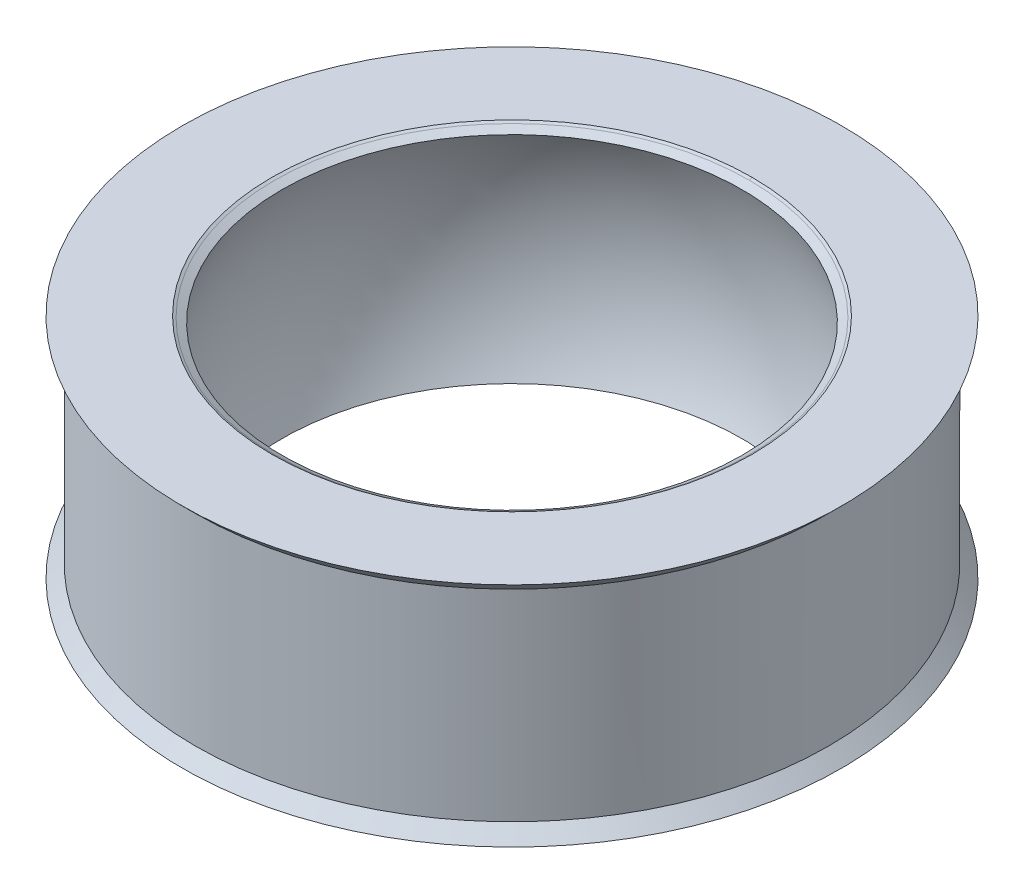
ISO-10303-21;
HEADER;
FILE_DESCRIPTION(('STEP AP214'),'2;1');
FILE_NAME('part.step','',(''),(''),'','','');
FILE_SCHEMA(('AUTOMOTIVE_DESIGN { 1 0 10303 214 1 1 1 1 }'));
ENDSEC;
DATA;
#1=APPLICATION_CONTEXT('core data for automotive mechanical design processes');
#2=APPLICATION_PROTOCOL_DEFINITION('international standard','automotive_design',2000,#1);
#3=PRODUCT_CONTEXT('',#1,'mechanical');
#4=PRODUCT('Part','Part','',(#3));
#5=PRODUCT_RELATED_PRODUCT_CATEGORY('part','',(#4));
#6=PRODUCT_DEFINITION_FORMATION('','',#4);
#7=PRODUCT_DEFINITION_CONTEXT('part definition',#1,'design');
#8=PRODUCT_DEFINITION('design','',#6,#7);
#9=PRODUCT_DEFINITION_SHAPE('','',#8);
#10=(LENGTH_UNIT() NAMED_UNIT(*) SI_UNIT(.MILLI.,.METRE.));
#11=(NAMED_UNIT(*) PLANE_ANGLE_UNIT() SI_UNIT($,.RADIAN.));
#12=(NAMED_UNIT(*) SI_UNIT($,.STERADIAN.) SOLID_ANGLE_UNIT());
#13=UNCERTAINTY_MEASURE_WITH_UNIT(LENGTH_MEASURE(1.E-05),#10,'distance_accuracy_value','');
#14=(GEOMETRIC_REPRESENTATION_CONTEXT(3) GLOBAL_UNCERTAINTY_ASSIGNED_CONTEXT((#13)) GLOBAL_UNIT_ASSIGNED_CONTEXT((#10,
#11,#12)) REPRESENTATION_CONTEXT('',''));
#15=CARTESIAN_POINT('',(0.,0.,0.));
#16=DIRECTION('',(0.,0.,1.));
#17=DIRECTION('',(1.,0.,0.));
#18=AXIS2_PLACEMENT_3D('',#15,#16,#17);
#19=CARTESIAN_POINT('',(0.,0.,49.2252));
#20=DIRECTION('',(0.,-1.,0.));
#21=DIRECTION('',(1.,0.,0.));
#22=AXIS2_PLACEMENT_3D('',#19,#20,#21);
#23=DEGENERATE_TOROIDAL_SURFACE('',#22,0.00761999999999423,7.52428396596868,.T.);
#24=CARTESIAN_POINT('',(0.,3.19567171044355,49.2252));
#25=DIRECTION('',(0.,1.,0.));
#26=DIRECTION('',(1.,0.,0.));
#27=AXIS2_PLACEMENT_3D('',#24,#25,#26);
#28=CIRCLE('',#27,6.81956036373776);
#29=CARTESIAN_POINT('',(6.81956036373776,3.19567171044355,49.2252));
#30=VERTEX_POINT('',#29);
#31=EDGE_CURVE('E76',#30,#30,#28,.T.);
#32=ORIENTED_EDGE('',*,*,#31,.T.);
#33=EDGE_LOOP('',(#32));
#34=FACE_BOUND('',#33,.T.);
#35=CARTESIAN_POINT('',(0.,-3.19567171044355,49.2252));
#36=DIRECTION('',(0.,-1.,0.));
#37=DIRECTION('',(1.,0.,0.));
#38=AXIS2_PLACEMENT_3D('',#35,#36,#37);
#39=CIRCLE('',#38,6.81956036373777);
#40=CARTESIAN_POINT('',(6.81956036373776,-3.19567171044355,49.2252));
#41=VERTEX_POINT('',#40);
#42=EDGE_CURVE('E139',#41,#41,#39,.T.);
#43=ORIENTED_EDGE('',*,*,#42,.T.);
#44=EDGE_LOOP('',(#43));
#45=FACE_BOUND('',#44,.T.);
#46=ADVANCED_FACE('F16',(#34,#45),#23,.F.);
#47=CARTESIAN_POINT('',(0.,-3.32307590758773,49.2252));
#48=DIRECTION('',(0.,-1.,0.));
#49=DIRECTION('',(1.,0.,0.));
#50=AXIS2_PLACEMENT_3D('',#47,#48,#49);
#51=CONICAL_SURFACE('',#50,7.0403198780582,1.04737208404976);
#52=ORIENTED_EDGE('',*,*,#42,.F.);
#53=EDGE_LOOP('',(#52));
#54=FACE_BOUND('',#53,.T.);
#55=CARTESIAN_POINT('',(0.,-3.32307529908155,49.2252));
#56=DIRECTION('',(0.,-1.,0.));
#57=DIRECTION('',(-1.,0.,0.));
#58=AXIS2_PLACEMENT_3D('',#55,#56,#57);
#59=CIRCLE('',#58,7.04031882366962);
#60=CARTESIAN_POINT('',(-7.04032305368385,-3.32306918858632,49.2252));
#61=VERTEX_POINT('',#60);
#62=CARTESIAN_POINT('',(0.,-3.32306897178951,42.184877287466));
#63=VERTEX_POINT('',#62);
#64=EDGE_CURVE('E172',#61,#63,#59,.T.);
#65=ORIENTED_EDGE('',*,*,#64,.T.);
#66=CARTESIAN_POINT('',(0.,-3.32307529908155,49.2252));
#67=DIRECTION('',(0.,-1.,0.));
#68=DIRECTION('',(0.,0.,-1.));
#69=AXIS2_PLACEMENT_3D('',#66,#67,#68);
#70=CIRCLE('',#69,7.04031882366962);
#71=CARTESIAN_POINT('',(0.,-3.32306904419921,56.2655227862084));
#72=VERTEX_POINT('',#71);
#73=EDGE_CURVE('E152',#63,#72,#70,.T.);
#74=ORIENTED_EDGE('',*,*,#73,.T.);
#75=CARTESIAN_POINT('',(0.,-3.32307590762054,49.2252));
#76=DIRECTION('',(0.,-1.,0.));
#77=DIRECTION('',(0.,0.,1.));
#78=AXIS2_PLACEMENT_3D('',#75,#76,#77);
#79=CIRCLE('',#78,7.04031987811504);
#80=EDGE_CURVE('E182',#72,#61,#79,.T.);
#81=ORIENTED_EDGE('',*,*,#80,.T.);
#82=EDGE_LOOP('',(#65,#74,#81));
#83=FACE_BOUND('',#82,.T.);
#84=ADVANCED_FACE('F113',(#54,#83),#51,.F.);
#85=CARTESIAN_POINT('',(0.,3.32307590753089,49.2252));
#86=DIRECTION('',(0.,1.,0.));
#87=DIRECTION('',(-1.,0.,0.));
#88=AXIS2_PLACEMENT_3D('',#85,#86,#87);
#89=CONICAL_SURFACE('',#88,7.04031987794451,1.04737208404976);
#90=ORIENTED_EDGE('',*,*,#31,.F.);
#91=EDGE_LOOP('',(#90));
#92=FACE_BOUND('',#91,.T.);
#93=CARTESIAN_POINT('',(0.,3.32307529909032,49.2252));
#94=DIRECTION('',(0.,1.,0.));
#95=DIRECTION('',(-1.,0.,0.));
#96=AXIS2_PLACEMENT_3D('',#93,#94,#95);
#97=CIRCLE('',#96,7.04031882366962);
#98=CARTESIAN_POINT('',(-7.04032305369739,3.32306918860768,49.2252));
#99=VERTEX_POINT('',#98);
#100=CARTESIAN_POINT('',(0.,3.32306907310474,56.2655228880295));
#101=VERTEX_POINT('',#100);
#102=EDGE_CURVE('E64',#99,#101,#97,.T.);
#103=ORIENTED_EDGE('',*,*,#102,.T.);
#104=CARTESIAN_POINT('',(0.,3.32307529909032,49.2252));
#105=DIRECTION('',(0.,1.,0.));
#106=DIRECTION('',(0.,0.,1.));
#107=AXIS2_PLACEMENT_3D('',#104,#105,#106);
#108=CIRCLE('',#107,7.04031882366962);
#109=CARTESIAN_POINT('',(0.,3.3230690442341,42.1848772137383));
#110=VERTEX_POINT('',#109);
#111=EDGE_CURVE('E66',#101,#110,#108,.T.);
#112=ORIENTED_EDGE('',*,*,#111,.T.);
#113=CARTESIAN_POINT('',(0.,3.32307590766211,49.2252));
#114=DIRECTION('',(0.,1.,0.));
#115=DIRECTION('',(0.,0.,-1.));
#116=AXIS2_PLACEMENT_3D('',#113,#114,#115);
#117=CIRCLE('',#116,7.04031987817189);
#118=EDGE_CURVE('E60',#110,#99,#117,.T.);
#119=ORIENTED_EDGE('',*,*,#118,.T.);
#120=EDGE_LOOP('',(#103,#112,#119));
#121=FACE_BOUND('',#120,.T.);
#122=ADVANCED_FACE('F63',(#92,#121),#89,.F.);
#123=CARTESIAN_POINT('',(0.,-3.36550000002944,49.2252));
#124=DIRECTION('',(0.,-1.,0.));
#125=DIRECTION('',(1.,0.,0.));
#126=AXIS2_PLACEMENT_3D('',#123,#124,#125);
#127=CONICAL_SURFACE('',#126,7.11383018816528,1.04719755107569);
#128=CARTESIAN_POINT('',(0.,-3.36549999991174,49.2252));
#129=DIRECTION('',(0.,-1.,0.));
#130=DIRECTION('',(1.,0.,0.));
#131=AXIS2_PLACEMENT_3D('',#128,#129,#130);
#132=CIRCLE('',#131,7.11383018796141);
#133=CARTESIAN_POINT('',(7.11383018796141,-3.36549999991174,49.2252));
#134=VERTEX_POINT('',#133);
#135=EDGE_CURVE('E201',#134,#134,#132,.F.);
#136=ORIENTED_EDGE('',*,*,#135,.F.);
#137=EDGE_LOOP('',(#136));
#138=FACE_BOUND('',#137,.T.);
#139=ORIENTED_EDGE('',*,*,#80,.F.);
#140=ORIENTED_EDGE('',*,*,#73,.F.);
#141=ORIENTED_EDGE('',*,*,#64,.F.);
#142=EDGE_LOOP('',(#139,#140,#141));
#143=FACE_BOUND('',#142,.T.);
#144=ADVANCED_FACE('F112',(#138,#143),#127,.F.);
#145=CARTESIAN_POINT('',(0.,3.36550000002944,49.2252));
#146=DIRECTION('',(0.,1.,0.));
#147=DIRECTION('',(-1.,0.,0.));
#148=AXIS2_PLACEMENT_3D('',#145,#146,#147);
#149=CONICAL_SURFACE('',#148,7.11383018816528,1.0471975510757);
#150=ORIENTED_EDGE('',*,*,#111,.F.);
#151=DIRECTION('',(0.,-0.499999999999998,-0.86602540378444));
#152=VECTOR('',#151,1.);
#153=CARTESIAN_POINT('',(-5.13632279984973E-12,288125.462836318,499098.4504));
#154=LINE('',#153,#152);
#155=CARTESIAN_POINT('',(0.,3.3655000000058,56.3390301880751));
#156=VERTEX_POINT('',#155);
#157=EDGE_CURVE('E34',#101,#156,#154,.F.);
#158=ORIENTED_EDGE('',*,*,#157,.T.);
#159=CARTESIAN_POINT('',(0.,3.36550000004301,49.2252));
#160=DIRECTION('',(0.,1.,0.));
#161=DIRECTION('',(-1.,0.,0.));
#162=AXIS2_PLACEMENT_3D('',#159,#160,#161);
#163=CIRCLE('',#162,7.11383018818879);
#164=CARTESIAN_POINT('',(0.,3.36549999997737,42.1113698118965));
#165=VERTEX_POINT('',#164);
#166=EDGE_CURVE('E39',#165,#156,#163,.F.);
#167=ORIENTED_EDGE('',*,*,#166,.F.);
#168=DIRECTION('',(0.,-0.499999999999998,0.86602540378444));
#169=VECTOR('',#168,1.);
#170=CARTESIAN_POINT('',(5.59795808259649E-11,288125.462836318,-499000.));
#171=LINE('',#170,#169);
#172=EDGE_CURVE('E204',#165,#110,#171,.T.);
#173=ORIENTED_EDGE('',*,*,#172,.T.);
#174=EDGE_LOOP('',(#150,#158,#167,#173));
#175=FACE_BOUND('',#174,.T.);
#176=ADVANCED_FACE('F91',(#175),#149,.F.);
#177=CARTESIAN_POINT('',(0.,3.36550000002944,49.2252));
#178=DIRECTION('',(0.,1.,0.));
#179=DIRECTION('',(-1.,0.,0.));
#180=AXIS2_PLACEMENT_3D('',#177,#178,#179);
#181=CONICAL_SURFACE('',#180,7.11383018816528,1.04719755123111);
#182=CARTESIAN_POINT('',(0.,3.36549999991174,49.2252));
#183=DIRECTION('',(0.,1.,0.));
#184=DIRECTION('',(-1.,0.,0.));
#185=AXIS2_PLACEMENT_3D('',#182,#183,#184);
#186=CIRCLE('',#185,7.11383018796141);
#187=EDGE_CURVE('E197',#156,#165,#186,.F.);
#188=ORIENTED_EDGE('',*,*,#187,.F.);
#189=ORIENTED_EDGE('',*,*,#157,.F.);
#190=ORIENTED_EDGE('',*,*,#102,.F.);
#191=ORIENTED_EDGE('',*,*,#118,.F.);
#192=ORIENTED_EDGE('',*,*,#172,.F.);
#193=EDGE_LOOP('',(#188,#189,#190,#191,#192));
#194=FACE_BOUND('',#193,.T.);
#195=ADVANCED_FACE('F73',(#194),#181,.F.);
#196=CARTESIAN_POINT('',(0.,-3.3655,49.2252));
#197=DIRECTION('',(0.,-1.,0.));
#198=DIRECTION('',(0.,0.,-1.));
#199=AXIS2_PLACEMENT_3D('',#196,#197,#198);
#200=PLANE('',#199);
#201=ORIENTED_EDGE('',*,*,#135,.T.);
#202=EDGE_LOOP('',(#201));
#203=FACE_BOUND('',#202,.T.);
#204=CARTESIAN_POINT('',(0.,-3.3655,49.2252));
#205=DIRECTION('',(0.,-1.,0.));
#206=DIRECTION('',(0.,0.,-1.));
#207=AXIS2_PLACEMENT_3D('',#204,#205,#206);
#208=CIRCLE('',#207,9.7663);
#209=CARTESIAN_POINT('',(0.,-3.3655,39.4589));
#210=VERTEX_POINT('',#209);
#211=EDGE_CURVE('E194',#210,#210,#208,.F.);
#212=ORIENTED_EDGE('',*,*,#211,.F.);
#213=EDGE_LOOP('',(#212));
#214=FACE_BOUND('',#213,.T.);
#215=ADVANCED_FACE('F90',(#203,#214),#200,.T.);
#216=CARTESIAN_POINT('',(0.,3.3655,49.2252));
#217=DIRECTION('',(0.,1.,0.));
#218=DIRECTION('',(0.,0.,1.));
#219=AXIS2_PLACEMENT_3D('',#216,#217,#218);
#220=PLANE('',#219);
#221=ORIENTED_EDGE('',*,*,#166,.T.);
#222=ORIENTED_EDGE('',*,*,#187,.T.);
#223=EDGE_LOOP('',(#221,#222));
#224=FACE_BOUND('',#223,.T.);
#225=CARTESIAN_POINT('',(0.,3.3655,49.2252));
#226=DIRECTION('',(0.,1.,0.));
#227=DIRECTION('',(-1.,0.,0.));
#228=AXIS2_PLACEMENT_3D('',#225,#226,#227);
#229=CIRCLE('',#228,9.7663);
#230=CARTESIAN_POINT('',(-9.7663,3.3655,49.2252));
#231=VERTEX_POINT('',#230);
#232=EDGE_CURVE('E186',#231,#231,#229,.F.);
#233=ORIENTED_EDGE('',*,*,#232,.F.);
#234=EDGE_LOOP('',(#233));
#235=FACE_BOUND('',#234,.T.);
#236=ADVANCED_FACE('F239',(#224,#235),#220,.T.);
#237=CARTESIAN_POINT('',(0.,-3.3655,49.2252));
#238=DIRECTION('',(0.,-1.,0.));
#239=DIRECTION('',(0.,0.,-1.));
#240=AXIS2_PLACEMENT_3D('',#237,#238,#239);
#241=CONICAL_SURFACE('',#240,9.7663,0.785398163397451);
#242=CARTESIAN_POINT('',(0.,-2.9845,49.2252));
#243=DIRECTION('',(0.,1.,0.));
#244=DIRECTION('',(0.,0.,1.));
#245=AXIS2_PLACEMENT_3D('',#242,#243,#244);
#246=CIRCLE('',#245,9.3853);
#247=CARTESIAN_POINT('',(0.,-2.9845,58.6105));
#248=VERTEX_POINT('',#247);
#249=EDGE_CURVE('E26',#248,#248,#246,.T.);
#250=ORIENTED_EDGE('',*,*,#249,.F.);
#251=EDGE_LOOP('',(#250));
#252=FACE_BOUND('',#251,.T.);
#253=ORIENTED_EDGE('',*,*,#211,.T.);
#254=EDGE_LOOP('',(#253));
#255=FACE_BOUND('',#254,.T.);
#256=ADVANCED_FACE('F232',(#252,#255),#241,.T.);
#257=CARTESIAN_POINT('',(0.,3.3655,49.2252));
#258=DIRECTION('',(0.,1.,0.));
#259=DIRECTION('',(-1.,0.,0.));
#260=AXIS2_PLACEMENT_3D('',#257,#258,#259);
#261=CONICAL_SURFACE('',#260,9.7663,0.785398163397448);
#262=ORIENTED_EDGE('',*,*,#232,.T.);
#263=EDGE_LOOP('',(#262));
#264=FACE_BOUND('',#263,.T.);
#265=CARTESIAN_POINT('',(0.,2.9845,49.2252));
#266=DIRECTION('',(0.,1.,0.));
#267=DIRECTION('',(0.,0.,1.));
#268=AXIS2_PLACEMENT_3D('',#265,#266,#267);
#269=CIRCLE('',#268,9.3853);
#270=CARTESIAN_POINT('',(0.,2.9845,58.6105));
#271=VERTEX_POINT('',#270);
#272=EDGE_CURVE('E11',#271,#271,#269,.F.);
#273=ORIENTED_EDGE('',*,*,#272,.F.);
#274=EDGE_LOOP('',(#273));
#275=FACE_BOUND('',#274,.T.);
#276=ADVANCED_FACE('F226',(#264,#275),#261,.T.);
#277=CARTESIAN_POINT('',(0.,0.,49.2252));
#278=DIRECTION('',(0.,1.,0.));
#279=DIRECTION('',(0.,0.,1.));
#280=AXIS2_PLACEMENT_3D('',#277,#278,#279);
#281=CYLINDRICAL_SURFACE('',#280,9.3853);
#282=ORIENTED_EDGE('',*,*,#249,.T.);
#283=EDGE_LOOP('',(#282));
#284=FACE_BOUND('',#283,.T.);
#285=ORIENTED_EDGE('',*,*,#272,.T.);
#286=EDGE_LOOP('',(#285));
#287=FACE_BOUND('',#286,.T.);
#288=ADVANCED_FACE('F224',(#284,#287),#281,.T.);
#289=CLOSED_SHELL('',(#46,#84,#122,#144,#176,#195,#215,#236,#256,#276,#288));
#290=MANIFOLD_SOLID_BREP('B1',#289);
#291=ADVANCED_BREP_SHAPE_REPRESENTATION('',(#18,#290),#14);
#292=SHAPE_DEFINITION_REPRESENTATION(#9,#291);
ENDSEC;
END-ISO-10303-21;
